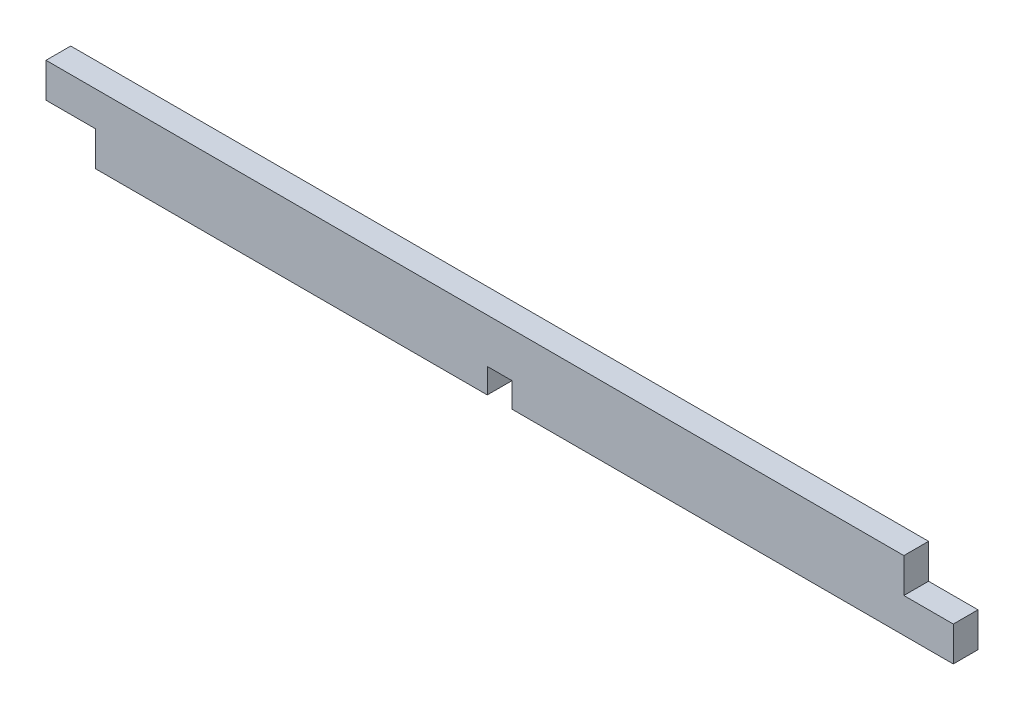
ISO-10303-21;
HEADER;
FILE_DESCRIPTION(('STEP AP214'),'2;1');
FILE_NAME('part.step','',(''),(''),'','','');
FILE_SCHEMA(('AUTOMOTIVE_DESIGN { 1 0 10303 214 1 1 1 1 }'));
ENDSEC;
DATA;
#1=APPLICATION_CONTEXT('core data for automotive mechanical design processes');
#2=APPLICATION_PROTOCOL_DEFINITION('international standard','automotive_design',2000,#1);
#3=PRODUCT_CONTEXT('',#1,'mechanical');
#4=PRODUCT('Part','Part','',(#3));
#5=PRODUCT_RELATED_PRODUCT_CATEGORY('part','',(#4));
#6=PRODUCT_DEFINITION_FORMATION('','',#4);
#7=PRODUCT_DEFINITION_CONTEXT('part definition',#1,'design');
#8=PRODUCT_DEFINITION('design','',#6,#7);
#9=PRODUCT_DEFINITION_SHAPE('','',#8);
#10=(LENGTH_UNIT() NAMED_UNIT(*) SI_UNIT(.MILLI.,.METRE.));
#11=(NAMED_UNIT(*) PLANE_ANGLE_UNIT() SI_UNIT($,.RADIAN.));
#12=(NAMED_UNIT(*) SI_UNIT($,.STERADIAN.) SOLID_ANGLE_UNIT());
#13=UNCERTAINTY_MEASURE_WITH_UNIT(LENGTH_MEASURE(1.E-05),#10,'distance_accuracy_value','');
#14=(GEOMETRIC_REPRESENTATION_CONTEXT(3) GLOBAL_UNCERTAINTY_ASSIGNED_CONTEXT((#13)) GLOBAL_UNIT_ASSIGNED_CONTEXT((#10,
#11,#12)) REPRESENTATION_CONTEXT('',''));
#15=CARTESIAN_POINT('',(0.,0.,0.));
#16=DIRECTION('',(0.,0.,1.));
#17=DIRECTION('',(1.,0.,0.));
#18=AXIS2_PLACEMENT_3D('',#15,#16,#17);
#19=CARTESIAN_POINT('',(-51.4,3.92,1.4));
#20=DIRECTION('',(0.,-1.,0.));
#21=DIRECTION('',(1.,0.,0.));
#22=AXIS2_PLACEMENT_3D('',#19,#20,#21);
#23=PLANE('',#22);
#24=DIRECTION('',(-1.,0.,0.));
#25=VECTOR('',#24,1.);
#26=CARTESIAN_POINT('',(-51.4,3.92,-1.4));
#27=LINE('',#26,#25);
#28=CARTESIAN_POINT('',(45.8,3.92000000000001,-1.4));
#29=VERTEX_POINT('',#28);
#30=CARTESIAN_POINT('',(-51.4,3.92,-1.4));
#31=VERTEX_POINT('',#30);
#32=EDGE_CURVE('E156',#29,#31,#27,.T.);
#33=ORIENTED_EDGE('',*,*,#32,.T.);
#34=DIRECTION('',(0.,0.,-1.));
#35=VECTOR('',#34,1.);
#36=CARTESIAN_POINT('',(-51.4,3.92,1.4));
#37=LINE('',#36,#35);
#38=CARTESIAN_POINT('',(-51.4,3.92,1.4));
#39=VERTEX_POINT('',#38);
#40=EDGE_CURVE('E11',#39,#31,#37,.T.);
#41=ORIENTED_EDGE('',*,*,#40,.F.);
#42=DIRECTION('',(-1.,0.,0.));
#43=VECTOR('',#42,1.);
#44=CARTESIAN_POINT('',(-51.4,3.92,1.4));
#45=LINE('',#44,#43);
#46=CARTESIAN_POINT('',(45.8,3.92000000000001,1.4));
#47=VERTEX_POINT('',#46);
#48=EDGE_CURVE('E178',#47,#39,#45,.T.);
#49=ORIENTED_EDGE('',*,*,#48,.F.);
#50=DIRECTION('',(0.,0.,-1.));
#51=VECTOR('',#50,1.);
#52=CARTESIAN_POINT('',(45.8,3.92000000000001,1.4));
#53=LINE('',#52,#51);
#54=EDGE_CURVE('E152',#47,#29,#53,.T.);
#55=ORIENTED_EDGE('',*,*,#54,.T.);
#56=EDGE_LOOP('',(#33,#41,#49,#55));
#57=FACE_BOUND('',#56,.T.);
#58=ADVANCED_FACE('F36',(#57),#23,.F.);
#59=CARTESIAN_POINT('',(-51.4,0.,1.4));
#60=DIRECTION('',(1.,0.,0.));
#61=DIRECTION('',(0.,0.,-1.));
#62=AXIS2_PLACEMENT_3D('',#59,#60,#61);
#63=PLANE('',#62);
#64=DIRECTION('',(0.,-1.,0.));
#65=VECTOR('',#64,1.);
#66=CARTESIAN_POINT('',(-51.4,0.,-1.4));
#67=LINE('',#66,#65);
#68=CARTESIAN_POINT('',(-51.4,0.,-1.4));
#69=VERTEX_POINT('',#68);
#70=EDGE_CURVE('E159',#31,#69,#67,.T.);
#71=ORIENTED_EDGE('',*,*,#70,.T.);
#72=DIRECTION('',(0.,0.,-1.));
#73=VECTOR('',#72,1.);
#74=CARTESIAN_POINT('',(-51.4,0.,1.4));
#75=LINE('',#74,#73);
#76=CARTESIAN_POINT('',(-51.4,0.,1.4));
#77=VERTEX_POINT('',#76);
#78=EDGE_CURVE('E44',#77,#69,#75,.T.);
#79=ORIENTED_EDGE('',*,*,#78,.F.);
#80=DIRECTION('',(0.,-1.,0.));
#81=VECTOR('',#80,1.);
#82=CARTESIAN_POINT('',(-51.4,0.,1.4));
#83=LINE('',#82,#81);
#84=EDGE_CURVE('E107',#39,#77,#83,.T.);
#85=ORIENTED_EDGE('',*,*,#84,.F.);
#86=ORIENTED_EDGE('',*,*,#40,.T.);
#87=EDGE_LOOP('',(#71,#79,#85,#86));
#88=FACE_BOUND('',#87,.T.);
#89=ADVANCED_FACE('F256',(#88),#63,.F.);
#90=CARTESIAN_POINT('',(-51.4,0.,1.4));
#91=DIRECTION('',(0.,1.,0.));
#92=DIRECTION('',(-1.,0.,0.));
#93=AXIS2_PLACEMENT_3D('',#90,#91,#92);
#94=PLANE('',#93);
#95=DIRECTION('',(1.,0.,0.));
#96=VECTOR('',#95,1.);
#97=CARTESIAN_POINT('',(-51.4,0.,-1.4));
#98=LINE('',#97,#96);
#99=CARTESIAN_POINT('',(-45.8,0.,-1.4));
#100=VERTEX_POINT('',#99);
#101=EDGE_CURVE('E161',#69,#100,#98,.T.);
#102=ORIENTED_EDGE('',*,*,#101,.T.);
#103=DIRECTION('',(0.,0.,-1.));
#104=VECTOR('',#103,1.);
#105=CARTESIAN_POINT('',(-45.8,0.,1.4));
#106=LINE('',#105,#104);
#107=CARTESIAN_POINT('',(-45.8,0.,1.4));
#108=VERTEX_POINT('',#107);
#109=EDGE_CURVE('E197',#108,#100,#106,.T.);
#110=ORIENTED_EDGE('',*,*,#109,.F.);
#111=DIRECTION('',(1.,0.,0.));
#112=VECTOR('',#111,1.);
#113=CARTESIAN_POINT('',(-51.4,0.,1.4));
#114=LINE('',#113,#112);
#115=EDGE_CURVE('E205',#77,#108,#114,.T.);
#116=ORIENTED_EDGE('',*,*,#115,.F.);
#117=ORIENTED_EDGE('',*,*,#78,.T.);
#118=EDGE_LOOP('',(#102,#110,#116,#117));
#119=FACE_BOUND('',#118,.T.);
#120=ADVANCED_FACE('F203',(#119),#94,.F.);
#121=CARTESIAN_POINT('',(-45.8,0.,1.4));
#122=DIRECTION('',(1.,0.,0.));
#123=DIRECTION('',(0.,0.,-1.));
#124=AXIS2_PLACEMENT_3D('',#121,#122,#123);
#125=PLANE('',#124);
#126=DIRECTION('',(0.,-1.,0.));
#127=VECTOR('',#126,1.);
#128=CARTESIAN_POINT('',(-45.8,0.,-1.4));
#129=LINE('',#128,#127);
#130=CARTESIAN_POINT('',(-45.8,-3.92,-1.4));
#131=VERTEX_POINT('',#130);
#132=EDGE_CURVE('E163',#100,#131,#129,.T.);
#133=ORIENTED_EDGE('',*,*,#132,.T.);
#134=DIRECTION('',(0.,0.,-1.));
#135=VECTOR('',#134,1.);
#136=CARTESIAN_POINT('',(-45.8,-3.92,1.4));
#137=LINE('',#136,#135);
#138=CARTESIAN_POINT('',(-45.8,-3.92,1.4));
#139=VERTEX_POINT('',#138);
#140=EDGE_CURVE('E194',#139,#131,#137,.T.);
#141=ORIENTED_EDGE('',*,*,#140,.F.);
#142=DIRECTION('',(0.,-1.,0.));
#143=VECTOR('',#142,1.);
#144=CARTESIAN_POINT('',(-45.8,0.,1.4));
#145=LINE('',#144,#143);
#146=EDGE_CURVE('E223',#108,#139,#145,.T.);
#147=ORIENTED_EDGE('',*,*,#146,.F.);
#148=ORIENTED_EDGE('',*,*,#109,.T.);
#149=EDGE_LOOP('',(#133,#141,#147,#148));
#150=FACE_BOUND('',#149,.T.);
#151=ADVANCED_FACE('F214',(#150),#125,.F.);
#152=CARTESIAN_POINT('',(-45.8,-3.92,1.4));
#153=DIRECTION('',(0.,1.,0.));
#154=DIRECTION('',(-1.,0.,0.));
#155=AXIS2_PLACEMENT_3D('',#152,#153,#154);
#156=PLANE('',#155);
#157=DIRECTION('',(1.,0.,0.));
#158=VECTOR('',#157,1.);
#159=CARTESIAN_POINT('',(-45.8,-3.92,-1.4));
#160=LINE('',#159,#158);
#161=CARTESIAN_POINT('',(-1.4,-3.92,-1.4));
#162=VERTEX_POINT('',#161);
#163=EDGE_CURVE('E165',#131,#162,#160,.T.);
#164=ORIENTED_EDGE('',*,*,#163,.T.);
#165=DIRECTION('',(0.,0.,-1.));
#166=VECTOR('',#165,1.);
#167=CARTESIAN_POINT('',(-1.4,-3.92,1.4));
#168=LINE('',#167,#166);
#169=CARTESIAN_POINT('',(-1.4,-3.92,1.4));
#170=VERTEX_POINT('',#169);
#171=EDGE_CURVE('E191',#170,#162,#168,.T.);
#172=ORIENTED_EDGE('',*,*,#171,.F.);
#173=DIRECTION('',(1.,0.,0.));
#174=VECTOR('',#173,1.);
#175=CARTESIAN_POINT('',(-45.8,-3.92,1.4));
#176=LINE('',#175,#174);
#177=EDGE_CURVE('E220',#139,#170,#176,.T.);
#178=ORIENTED_EDGE('',*,*,#177,.F.);
#179=ORIENTED_EDGE('',*,*,#140,.T.);
#180=EDGE_LOOP('',(#164,#172,#178,#179));
#181=FACE_BOUND('',#180,.T.);
#182=ADVANCED_FACE('F218',(#181),#156,.F.);
#183=CARTESIAN_POINT('',(-1.4,-3.92,1.4));
#184=DIRECTION('',(-1.,0.,0.));
#185=DIRECTION('',(0.,-1.,0.));
#186=AXIS2_PLACEMENT_3D('',#183,#184,#185);
#187=PLANE('',#186);
#188=DIRECTION('',(0.,1.,0.));
#189=VECTOR('',#188,1.);
#190=CARTESIAN_POINT('',(-1.4,-3.92,-1.4));
#191=LINE('',#190,#189);
#192=CARTESIAN_POINT('',(-1.4,-1.12,-1.4));
#193=VERTEX_POINT('',#192);
#194=EDGE_CURVE('E167',#162,#193,#191,.T.);
#195=ORIENTED_EDGE('',*,*,#194,.T.);
#196=DIRECTION('',(0.,0.,-1.));
#197=VECTOR('',#196,1.);
#198=CARTESIAN_POINT('',(-1.4,-1.12,1.4));
#199=LINE('',#198,#197);
#200=CARTESIAN_POINT('',(-1.4,-1.12,1.4));
#201=VERTEX_POINT('',#200);
#202=EDGE_CURVE('E188',#201,#193,#199,.T.);
#203=ORIENTED_EDGE('',*,*,#202,.F.);
#204=DIRECTION('',(0.,1.,0.));
#205=VECTOR('',#204,1.);
#206=CARTESIAN_POINT('',(-1.4,-3.92,1.4));
#207=LINE('',#206,#205);
#208=EDGE_CURVE('E222',#170,#201,#207,.T.);
#209=ORIENTED_EDGE('',*,*,#208,.F.);
#210=ORIENTED_EDGE('',*,*,#171,.T.);
#211=EDGE_LOOP('',(#195,#203,#209,#210));
#212=FACE_BOUND('',#211,.T.);
#213=ADVANCED_FACE('F269',(#212),#187,.F.);
#214=CARTESIAN_POINT('',(-1.4,-1.12,1.4));
#215=DIRECTION('',(0.,1.,0.));
#216=DIRECTION('',(0.,0.,1.));
#217=AXIS2_PLACEMENT_3D('',#214,#215,#216);
#218=PLANE('',#217);
#219=DIRECTION('',(1.,0.,0.));
#220=VECTOR('',#219,1.);
#221=CARTESIAN_POINT('',(-1.4,-1.12,-1.4));
#222=LINE('',#221,#220);
#223=CARTESIAN_POINT('',(1.4,-1.12,-1.4));
#224=VERTEX_POINT('',#223);
#225=EDGE_CURVE('E169',#193,#224,#222,.T.);
#226=ORIENTED_EDGE('',*,*,#225,.T.);
#227=DIRECTION('',(0.,0.,-1.));
#228=VECTOR('',#227,1.);
#229=CARTESIAN_POINT('',(1.4,-1.12,1.4));
#230=LINE('',#229,#228);
#231=CARTESIAN_POINT('',(1.4,-1.12,1.4));
#232=VERTEX_POINT('',#231);
#233=EDGE_CURVE('E185',#232,#224,#230,.T.);
#234=ORIENTED_EDGE('',*,*,#233,.F.);
#235=DIRECTION('',(1.,0.,0.));
#236=VECTOR('',#235,1.);
#237=CARTESIAN_POINT('',(-1.4,-1.12,1.4));
#238=LINE('',#237,#236);
#239=EDGE_CURVE('E225',#201,#232,#238,.T.);
#240=ORIENTED_EDGE('',*,*,#239,.F.);
#241=ORIENTED_EDGE('',*,*,#202,.T.);
#242=EDGE_LOOP('',(#226,#234,#240,#241));
#243=FACE_BOUND('',#242,.T.);
#244=ADVANCED_FACE('F272',(#243),#218,.F.);
#245=CARTESIAN_POINT('',(1.40000000000001,-3.92,1.4));
#246=DIRECTION('',(1.,0.,0.));
#247=DIRECTION('',(0.,1.,0.));
#248=AXIS2_PLACEMENT_3D('',#245,#246,#247);
#249=PLANE('',#248);
#250=DIRECTION('',(0.,-1.,0.));
#251=VECTOR('',#250,1.);
#252=CARTESIAN_POINT('',(1.40000000000001,-3.92,-1.4));
#253=LINE('',#252,#251);
#254=CARTESIAN_POINT('',(1.40000000000001,-3.92,-1.4));
#255=VERTEX_POINT('',#254);
#256=EDGE_CURVE('E171',#224,#255,#253,.T.);
#257=ORIENTED_EDGE('',*,*,#256,.T.);
#258=DIRECTION('',(0.,0.,-1.));
#259=VECTOR('',#258,1.);
#260=CARTESIAN_POINT('',(1.40000000000001,-3.92,1.4));
#261=LINE('',#260,#259);
#262=CARTESIAN_POINT('',(1.40000000000001,-3.92,1.4));
#263=VERTEX_POINT('',#262);
#264=EDGE_CURVE('E182',#263,#255,#261,.T.);
#265=ORIENTED_EDGE('',*,*,#264,.F.);
#266=DIRECTION('',(0.,-1.,0.));
#267=VECTOR('',#266,1.);
#268=CARTESIAN_POINT('',(1.40000000000001,-3.92,1.4));
#269=LINE('',#268,#267);
#270=EDGE_CURVE('E231',#232,#263,#269,.T.);
#271=ORIENTED_EDGE('',*,*,#270,.F.);
#272=ORIENTED_EDGE('',*,*,#233,.T.);
#273=EDGE_LOOP('',(#257,#265,#271,#272));
#274=FACE_BOUND('',#273,.T.);
#275=ADVANCED_FACE('F237',(#274),#249,.F.);
#276=CARTESIAN_POINT('',(1.40000000000001,-3.92,1.4));
#277=DIRECTION('',(0.,1.,0.));
#278=DIRECTION('',(-1.,0.,0.));
#279=AXIS2_PLACEMENT_3D('',#276,#277,#278);
#280=PLANE('',#279);
#281=DIRECTION('',(1.,0.,0.));
#282=VECTOR('',#281,1.);
#283=CARTESIAN_POINT('',(1.40000000000001,-3.92,-1.4));
#284=LINE('',#283,#282);
#285=CARTESIAN_POINT('',(51.4,-3.91999999999999,-1.4));
#286=VERTEX_POINT('',#285);
#287=EDGE_CURVE('E173',#255,#286,#284,.T.);
#288=ORIENTED_EDGE('',*,*,#287,.T.);
#289=DIRECTION('',(0.,0.,-1.));
#290=VECTOR('',#289,1.);
#291=CARTESIAN_POINT('',(51.4,-3.91999999999999,1.4));
#292=LINE('',#291,#290);
#293=CARTESIAN_POINT('',(51.4,-3.91999999999999,1.4));
#294=VERTEX_POINT('',#293);
#295=EDGE_CURVE('E147',#294,#286,#292,.T.);
#296=ORIENTED_EDGE('',*,*,#295,.F.);
#297=DIRECTION('',(1.,0.,0.));
#298=VECTOR('',#297,1.);
#299=CARTESIAN_POINT('',(1.40000000000001,-3.92,1.4));
#300=LINE('',#299,#298);
#301=EDGE_CURVE('E138',#263,#294,#300,.T.);
#302=ORIENTED_EDGE('',*,*,#301,.F.);
#303=ORIENTED_EDGE('',*,*,#264,.T.);
#304=EDGE_LOOP('',(#288,#296,#302,#303));
#305=FACE_BOUND('',#304,.T.);
#306=ADVANCED_FACE('F241',(#305),#280,.F.);
#307=CARTESIAN_POINT('',(51.4,-3.91999999999999,1.4));
#308=DIRECTION('',(-1.,0.,0.));
#309=DIRECTION('',(0.,0.,1.));
#310=AXIS2_PLACEMENT_3D('',#307,#308,#309);
#311=PLANE('',#310);
#312=DIRECTION('',(0.,1.,0.));
#313=VECTOR('',#312,1.);
#314=CARTESIAN_POINT('',(51.4,-3.91999999999999,-1.4));
#315=LINE('',#314,#313);
#316=CARTESIAN_POINT('',(51.4,0.,-1.4));
#317=VERTEX_POINT('',#316);
#318=EDGE_CURVE('E146',#286,#317,#315,.T.);
#319=ORIENTED_EDGE('',*,*,#318,.T.);
#320=DIRECTION('',(0.,0.,-1.));
#321=VECTOR('',#320,1.);
#322=CARTESIAN_POINT('',(51.4,0.,1.4));
#323=LINE('',#322,#321);
#324=CARTESIAN_POINT('',(51.4,0.,1.4));
#325=VERTEX_POINT('',#324);
#326=EDGE_CURVE('E143',#325,#317,#323,.T.);
#327=ORIENTED_EDGE('',*,*,#326,.F.);
#328=DIRECTION('',(0.,1.,0.));
#329=VECTOR('',#328,1.);
#330=CARTESIAN_POINT('',(51.4,-3.91999999999999,1.4));
#331=LINE('',#330,#329);
#332=EDGE_CURVE('E132',#294,#325,#331,.T.);
#333=ORIENTED_EDGE('',*,*,#332,.F.);
#334=ORIENTED_EDGE('',*,*,#295,.T.);
#335=EDGE_LOOP('',(#319,#327,#333,#334));
#336=FACE_BOUND('',#335,.T.);
#337=ADVANCED_FACE('F144',(#336),#311,.F.);
#338=CARTESIAN_POINT('',(45.8,0.,1.4));
#339=DIRECTION('',(0.,-1.,0.));
#340=DIRECTION('',(0.,0.,-1.));
#341=AXIS2_PLACEMENT_3D('',#338,#339,#340);
#342=PLANE('',#341);
#343=DIRECTION('',(-1.,0.,0.));
#344=VECTOR('',#343,1.);
#345=CARTESIAN_POINT('',(45.8,0.,-1.4));
#346=LINE('',#345,#344);
#347=CARTESIAN_POINT('',(45.8,0.,-1.4));
#348=VERTEX_POINT('',#347);
#349=EDGE_CURVE('E93',#317,#348,#346,.T.);
#350=ORIENTED_EDGE('',*,*,#349,.T.);
#351=DIRECTION('',(0.,0.,-1.));
#352=VECTOR('',#351,1.);
#353=CARTESIAN_POINT('',(45.8,0.,1.4));
#354=LINE('',#353,#352);
#355=CARTESIAN_POINT('',(45.8,0.,1.4));
#356=VERTEX_POINT('',#355);
#357=EDGE_CURVE('E148',#356,#348,#354,.T.);
#358=ORIENTED_EDGE('',*,*,#357,.F.);
#359=DIRECTION('',(-1.,0.,0.));
#360=VECTOR('',#359,1.);
#361=CARTESIAN_POINT('',(45.8,0.,1.4));
#362=LINE('',#361,#360);
#363=EDGE_CURVE('E136',#325,#356,#362,.T.);
#364=ORIENTED_EDGE('',*,*,#363,.F.);
#365=ORIENTED_EDGE('',*,*,#326,.T.);
#366=EDGE_LOOP('',(#350,#358,#364,#365));
#367=FACE_BOUND('',#366,.T.);
#368=ADVANCED_FACE('F150',(#367),#342,.F.);
#369=CARTESIAN_POINT('',(45.8,3.92000000000001,1.4));
#370=DIRECTION('',(-1.,0.,0.));
#371=DIRECTION('',(0.,0.,1.));
#372=AXIS2_PLACEMENT_3D('',#369,#370,#371);
#373=PLANE('',#372);
#374=DIRECTION('',(0.,1.,0.));
#375=VECTOR('',#374,1.);
#376=CARTESIAN_POINT('',(45.8,3.92000000000001,-1.4));
#377=LINE('',#376,#375);
#378=EDGE_CURVE('E99',#348,#29,#377,.T.);
#379=ORIENTED_EDGE('',*,*,#378,.T.);
#380=ORIENTED_EDGE('',*,*,#54,.F.);
#381=DIRECTION('',(0.,1.,0.));
#382=VECTOR('',#381,1.);
#383=CARTESIAN_POINT('',(45.8,3.92000000000001,1.4));
#384=LINE('',#383,#382);
#385=EDGE_CURVE('E52',#356,#47,#384,.T.);
#386=ORIENTED_EDGE('',*,*,#385,.F.);
#387=ORIENTED_EDGE('',*,*,#357,.T.);
#388=EDGE_LOOP('',(#379,#380,#386,#387));
#389=FACE_BOUND('',#388,.T.);
#390=ADVANCED_FACE('F245',(#389),#373,.F.);
#391=CARTESIAN_POINT('',(0.,0.,1.4));
#392=DIRECTION('',(0.,0.,-1.));
#393=DIRECTION('',(-1.,0.,0.));
#394=AXIS2_PLACEMENT_3D('',#391,#392,#393);
#395=PLANE('',#394);
#396=ORIENTED_EDGE('',*,*,#48,.T.);
#397=ORIENTED_EDGE('',*,*,#84,.T.);
#398=ORIENTED_EDGE('',*,*,#115,.T.);
#399=ORIENTED_EDGE('',*,*,#146,.T.);
#400=ORIENTED_EDGE('',*,*,#177,.T.);
#401=ORIENTED_EDGE('',*,*,#208,.T.);
#402=ORIENTED_EDGE('',*,*,#239,.T.);
#403=ORIENTED_EDGE('',*,*,#270,.T.);
#404=ORIENTED_EDGE('',*,*,#301,.T.);
#405=ORIENTED_EDGE('',*,*,#332,.T.);
#406=ORIENTED_EDGE('',*,*,#363,.T.);
#407=ORIENTED_EDGE('',*,*,#385,.T.);
#408=EDGE_LOOP('',(#396,#397,#398,#399,#400,#401,#402,#403,#404,#405,#406,#407));
#409=FACE_BOUND('',#408,.T.);
#410=ADVANCED_FACE('F134',(#409),#395,.F.);
#411=CARTESIAN_POINT('',(0.,0.,-1.4));
#412=DIRECTION('',(0.,0.,-1.));
#413=DIRECTION('',(-1.,0.,0.));
#414=AXIS2_PLACEMENT_3D('',#411,#412,#413);
#415=PLANE('',#414);
#416=ORIENTED_EDGE('',*,*,#32,.F.);
#417=ORIENTED_EDGE('',*,*,#378,.F.);
#418=ORIENTED_EDGE('',*,*,#349,.F.);
#419=ORIENTED_EDGE('',*,*,#318,.F.);
#420=ORIENTED_EDGE('',*,*,#287,.F.);
#421=ORIENTED_EDGE('',*,*,#256,.F.);
#422=ORIENTED_EDGE('',*,*,#225,.F.);
#423=ORIENTED_EDGE('',*,*,#194,.F.);
#424=ORIENTED_EDGE('',*,*,#163,.F.);
#425=ORIENTED_EDGE('',*,*,#132,.F.);
#426=ORIENTED_EDGE('',*,*,#101,.F.);
#427=ORIENTED_EDGE('',*,*,#70,.F.);
#428=EDGE_LOOP('',(#416,#417,#418,#419,#420,#421,#422,#423,#424,#425,#426,#427));
#429=FACE_BOUND('',#428,.T.);
#430=ADVANCED_FACE('F209',(#429),#415,.T.);
#431=CLOSED_SHELL('',(#58,#89,#120,#151,#182,#213,#244,#275,#306,#337,#368,#390,#410,#430));
#432=MANIFOLD_SOLID_BREP('B2',#431);
#433=ADVANCED_BREP_SHAPE_REPRESENTATION('',(#18,#432),#14);
#434=SHAPE_DEFINITION_REPRESENTATION(#9,#433);
ENDSEC;
END-ISO-10303-21;
